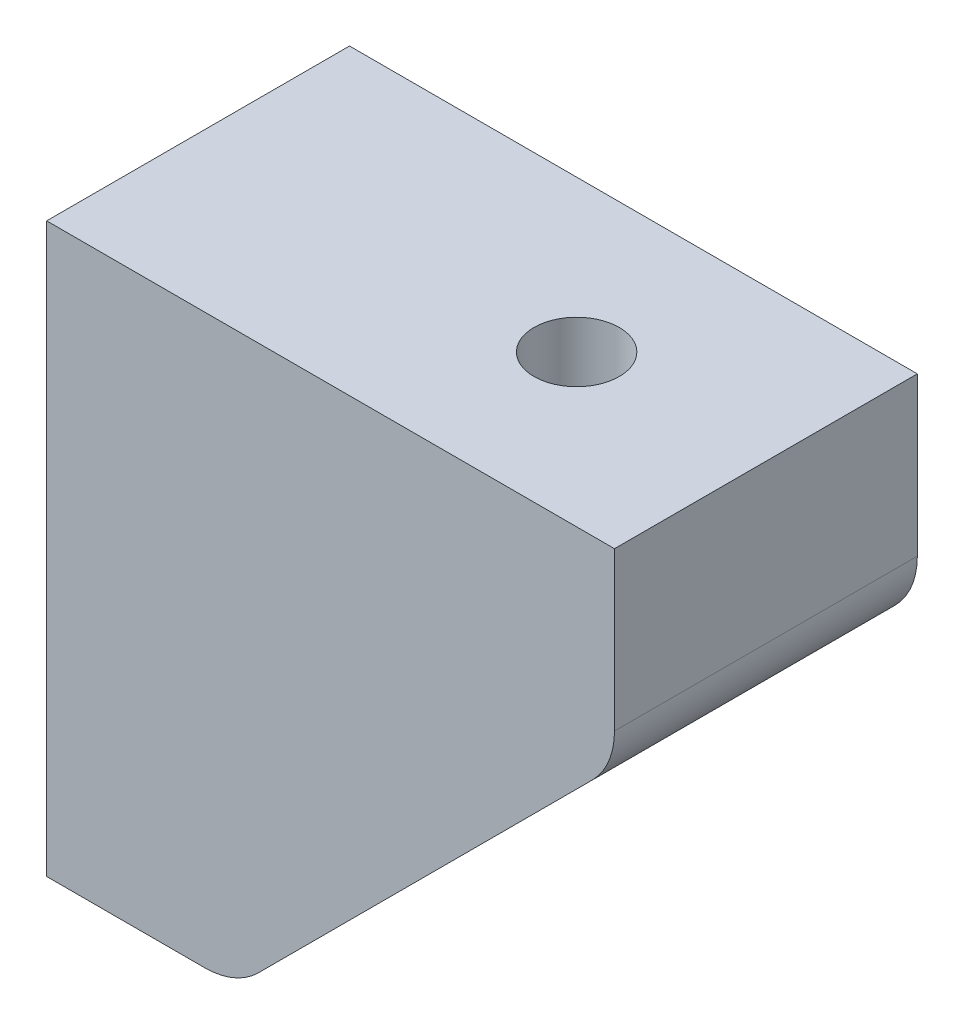
ISO-10303-21;
HEADER;
FILE_DESCRIPTION(('STEP AP214'),'2;1');
FILE_NAME('part.step','',(''),(''),'','','');
FILE_SCHEMA(('AUTOMOTIVE_DESIGN { 1 0 10303 214 1 1 1 1 }'));
ENDSEC;
DATA;
#1=APPLICATION_CONTEXT('core data for automotive mechanical design processes');
#2=APPLICATION_PROTOCOL_DEFINITION('international standard','automotive_design',2000,#1);
#3=PRODUCT_CONTEXT('',#1,'mechanical');
#4=PRODUCT('Part','Part','',(#3));
#5=PRODUCT_RELATED_PRODUCT_CATEGORY('part','',(#4));
#6=PRODUCT_DEFINITION_FORMATION('','',#4);
#7=PRODUCT_DEFINITION_CONTEXT('part definition',#1,'design');
#8=PRODUCT_DEFINITION('design','',#6,#7);
#9=PRODUCT_DEFINITION_SHAPE('','',#8);
#10=(LENGTH_UNIT() NAMED_UNIT(*) SI_UNIT(.MILLI.,.METRE.));
#11=(NAMED_UNIT(*) PLANE_ANGLE_UNIT() SI_UNIT($,.RADIAN.));
#12=(NAMED_UNIT(*) SI_UNIT($,.STERADIAN.) SOLID_ANGLE_UNIT());
#13=UNCERTAINTY_MEASURE_WITH_UNIT(LENGTH_MEASURE(1.E-05),#10,'distance_accuracy_value','');
#14=(GEOMETRIC_REPRESENTATION_CONTEXT(3) GLOBAL_UNCERTAINTY_ASSIGNED_CONTEXT((#13)) GLOBAL_UNIT_ASSIGNED_CONTEXT((#10,
#11,#12)) REPRESENTATION_CONTEXT('',''));
#15=CARTESIAN_POINT('',(0.,0.,0.));
#16=DIRECTION('',(0.,0.,1.));
#17=DIRECTION('',(1.,0.,0.));
#18=AXIS2_PLACEMENT_3D('',#15,#16,#17);
#19=CARTESIAN_POINT('',(0.,30.0000000000001,16.));
#20=DIRECTION('',(1.,0.,0.));
#21=DIRECTION('',(0.,1.,0.));
#22=AXIS2_PLACEMENT_3D('',#19,#20,#21);
#23=PLANE('',#22);
#24=CARTESIAN_POINT('',(0.,10.,8.));
#25=DIRECTION('',(-1.,0.,0.));
#26=DIRECTION('',(0.,-1.,0.));
#27=AXIS2_PLACEMENT_3D('',#24,#25,#26);
#28=CIRCLE('',#27,2.5);
#29=CARTESIAN_POINT('',(0.,7.50000000000004,8.));
#30=VERTEX_POINT('',#29);
#31=EDGE_CURVE('E231',#30,#30,#28,.T.);
#32=ORIENTED_EDGE('',*,*,#31,.F.);
#33=EDGE_LOOP('',(#32));
#34=FACE_BOUND('',#33,.T.);
#35=DIRECTION('',(0.,-1.,0.));
#36=VECTOR('',#35,1.);
#37=CARTESIAN_POINT('',(0.,30.0000000000001,0.));
#38=LINE('',#37,#36);
#39=CARTESIAN_POINT('',(0.,30.0000000000001,0.));
#40=VERTEX_POINT('',#39);
#41=CARTESIAN_POINT('',(0.,0.,0.));
#42=VERTEX_POINT('',#41);
#43=EDGE_CURVE('E127',#40,#42,#38,.T.);
#44=ORIENTED_EDGE('',*,*,#43,.T.);
#45=DIRECTION('',(0.,0.,-1.));
#46=VECTOR('',#45,1.);
#47=CARTESIAN_POINT('',(0.,0.,16.));
#48=LINE('',#47,#46);
#49=CARTESIAN_POINT('',(0.,0.,16.));
#50=VERTEX_POINT('',#49);
#51=EDGE_CURVE('E109',#50,#42,#48,.T.);
#52=ORIENTED_EDGE('',*,*,#51,.F.);
#53=DIRECTION('',(0.,-1.,0.));
#54=VECTOR('',#53,1.);
#55=CARTESIAN_POINT('',(0.,30.0000000000001,16.));
#56=LINE('',#55,#54);
#57=CARTESIAN_POINT('',(0.,30.0000000000001,16.));
#58=VERTEX_POINT('',#57);
#59=EDGE_CURVE('E114',#58,#50,#56,.T.);
#60=ORIENTED_EDGE('',*,*,#59,.F.);
#61=DIRECTION('',(0.,0.,-1.));
#62=VECTOR('',#61,1.);
#63=CARTESIAN_POINT('',(0.,30.0000000000001,16.));
#64=LINE('',#63,#62);
#65=EDGE_CURVE('E138',#58,#40,#64,.T.);
#66=ORIENTED_EDGE('',*,*,#65,.T.);
#67=EDGE_LOOP('',(#44,#52,#60,#66));
#68=FACE_BOUND('',#67,.T.);
#69=ADVANCED_FACE('F45',(#34,#68),#23,.F.);
#70=CARTESIAN_POINT('',(0.,0.,16.));
#71=DIRECTION('',(0.,1.,0.));
#72=DIRECTION('',(0.,0.,1.));
#73=AXIS2_PLACEMENT_3D('',#70,#71,#72);
#74=PLANE('',#73);
#75=DIRECTION('',(1.,0.,0.));
#76=VECTOR('',#75,1.);
#77=CARTESIAN_POINT('',(0.,0.,0.));
#78=LINE('',#77,#76);
#79=CARTESIAN_POINT('',(8.34314575050761,0.,0.));
#80=VERTEX_POINT('',#79);
#81=EDGE_CURVE('E253',#42,#80,#78,.T.);
#82=ORIENTED_EDGE('',*,*,#81,.T.);
#83=DIRECTION('',(0.,0.,-1.));
#84=VECTOR('',#83,1.);
#85=CARTESIAN_POINT('',(8.34314575050762,0.,16.));
#86=LINE('',#85,#84);
#87=CARTESIAN_POINT('',(8.34314575050761,0.,16.));
#88=VERTEX_POINT('',#87);
#89=EDGE_CURVE('E69',#80,#88,#86,.F.);
#90=ORIENTED_EDGE('',*,*,#89,.T.);
#91=DIRECTION('',(1.,0.,0.));
#92=VECTOR('',#91,1.);
#93=CARTESIAN_POINT('',(0.,0.,16.));
#94=LINE('',#93,#92);
#95=EDGE_CURVE('E105',#50,#88,#94,.T.);
#96=ORIENTED_EDGE('',*,*,#95,.F.);
#97=ORIENTED_EDGE('',*,*,#51,.T.);
#98=EDGE_LOOP('',(#82,#90,#96,#97));
#99=FACE_BOUND('',#98,.T.);
#100=ADVANCED_FACE('F107',(#99),#74,.F.);
#101=CARTESIAN_POINT('',(10.,0.,16.));
#102=DIRECTION('',(-0.707106781186549,0.707106781186546,0.));
#103=DIRECTION('',(-0.707106781186546,-0.707106781186549,0.));
#104=AXIS2_PLACEMENT_3D('',#101,#102,#103);
#105=PLANE('',#104);
#106=CARTESIAN_POINT('',(20.,10.,8.));
#107=DIRECTION('',(-0.707106781186549,0.707106781186546,0.));
#108=DIRECTION('',(-0.707106781186546,-0.707106781186549,0.));
#109=AXIS2_PLACEMENT_3D('',#106,#107,#108);
#110=ELLIPSE('',#109,7.07106781186547,5.);
#111=CARTESIAN_POINT('',(15.,5.00000000000004,8.));
#112=VERTEX_POINT('',#111);
#113=EDGE_CURVE('E228',#112,#112,#110,.T.);
#114=ORIENTED_EDGE('',*,*,#113,.T.);
#115=EDGE_LOOP('',(#114));
#116=FACE_BOUND('',#115,.T.);
#117=DIRECTION('',(0.707106781186546,0.707106781186549,0.));
#118=VECTOR('',#117,1.);
#119=CARTESIAN_POINT('',(10.,0.,16.));
#120=LINE('',#119,#118);
#121=CARTESIAN_POINT('',(11.1715728752538,1.17157287525382,16.));
#122=VERTEX_POINT('',#121);
#123=CARTESIAN_POINT('',(28.8284271247462,18.8284271247463,16.));
#124=VERTEX_POINT('',#123);
#125=EDGE_CURVE('E113',#122,#124,#120,.T.);
#126=ORIENTED_EDGE('',*,*,#125,.F.);
#127=DIRECTION('',(0.,0.,-1.));
#128=VECTOR('',#127,1.);
#129=CARTESIAN_POINT('',(11.1715728752538,1.17157287525382,16.));
#130=LINE('',#129,#128);
#131=CARTESIAN_POINT('',(11.1715728752538,1.17157287525382,0.));
#132=VERTEX_POINT('',#131);
#133=EDGE_CURVE('E197',#122,#132,#130,.T.);
#134=ORIENTED_EDGE('',*,*,#133,.T.);
#135=DIRECTION('',(0.707106781186546,0.707106781186549,0.));
#136=VECTOR('',#135,1.);
#137=CARTESIAN_POINT('',(10.,0.,0.));
#138=LINE('',#137,#136);
#139=CARTESIAN_POINT('',(28.8284271247462,18.8284271247463,0.));
#140=VERTEX_POINT('',#139);
#141=EDGE_CURVE('E256',#132,#140,#138,.T.);
#142=ORIENTED_EDGE('',*,*,#141,.T.);
#143=DIRECTION('',(0.,0.,-1.));
#144=VECTOR('',#143,1.);
#145=CARTESIAN_POINT('',(28.8284271247462,18.8284271247463,16.));
#146=LINE('',#145,#144);
#147=EDGE_CURVE('E213',#140,#124,#146,.F.);
#148=ORIENTED_EDGE('',*,*,#147,.T.);
#149=EDGE_LOOP('',(#126,#134,#142,#148));
#150=FACE_BOUND('',#149,.T.);
#151=ADVANCED_FACE('F178',(#116,#150),#105,.F.);
#152=CARTESIAN_POINT('',(30.,20.0000000000001,16.));
#153=DIRECTION('',(-1.,0.,0.));
#154=DIRECTION('',(0.,0.,1.));
#155=AXIS2_PLACEMENT_3D('',#152,#153,#154);
#156=PLANE('',#155);
#157=DIRECTION('',(0.,1.,0.));
#158=VECTOR('',#157,1.);
#159=CARTESIAN_POINT('',(30.,20.0000000000001,16.));
#160=LINE('',#159,#158);
#161=CARTESIAN_POINT('',(30.,21.6568542494925,16.));
#162=VERTEX_POINT('',#161);
#163=CARTESIAN_POINT('',(30.,30.0000000000001,16.));
#164=VERTEX_POINT('',#163);
#165=EDGE_CURVE('E246',#162,#164,#160,.T.);
#166=ORIENTED_EDGE('',*,*,#165,.F.);
#167=DIRECTION('',(0.,0.,-1.));
#168=VECTOR('',#167,1.);
#169=CARTESIAN_POINT('',(30.,21.6568542494925,16.));
#170=LINE('',#169,#168);
#171=CARTESIAN_POINT('',(30.,21.6568542494925,0.));
#172=VERTEX_POINT('',#171);
#173=EDGE_CURVE('E11',#162,#172,#170,.T.);
#174=ORIENTED_EDGE('',*,*,#173,.T.);
#175=DIRECTION('',(0.,1.,0.));
#176=VECTOR('',#175,1.);
#177=CARTESIAN_POINT('',(30.,20.0000000000001,0.));
#178=LINE('',#177,#176);
#179=CARTESIAN_POINT('',(30.,30.0000000000001,0.));
#180=VERTEX_POINT('',#179);
#181=EDGE_CURVE('E260',#172,#180,#178,.T.);
#182=ORIENTED_EDGE('',*,*,#181,.T.);
#183=DIRECTION('',(0.,0.,-1.));
#184=VECTOR('',#183,1.);
#185=CARTESIAN_POINT('',(30.,30.0000000000001,16.));
#186=LINE('',#185,#184);
#187=EDGE_CURVE('E130',#164,#180,#186,.T.);
#188=ORIENTED_EDGE('',*,*,#187,.F.);
#189=EDGE_LOOP('',(#166,#174,#182,#188));
#190=FACE_BOUND('',#189,.T.);
#191=ADVANCED_FACE('F275',(#190),#156,.F.);
#192=CARTESIAN_POINT('',(30.,30.0000000000001,16.));
#193=DIRECTION('',(0.,-1.,0.));
#194=DIRECTION('',(1.,0.,0.));
#195=AXIS2_PLACEMENT_3D('',#192,#193,#194);
#196=PLANE('',#195);
#197=CARTESIAN_POINT('',(20.,30.0000000000001,8.));
#198=DIRECTION('',(0.,1.,0.));
#199=DIRECTION('',(-1.,0.,0.));
#200=AXIS2_PLACEMENT_3D('',#197,#198,#199);
#201=CIRCLE('',#200,2.25);
#202=CARTESIAN_POINT('',(17.75,30.0000000000001,8.));
#203=VERTEX_POINT('',#202);
#204=EDGE_CURVE('E236',#203,#203,#201,.T.);
#205=ORIENTED_EDGE('',*,*,#204,.F.);
#206=EDGE_LOOP('',(#205));
#207=FACE_BOUND('',#206,.T.);
#208=DIRECTION('',(-1.,0.,0.));
#209=VECTOR('',#208,1.);
#210=CARTESIAN_POINT('',(30.,30.0000000000001,0.));
#211=LINE('',#210,#209);
#212=EDGE_CURVE('E124',#180,#40,#211,.T.);
#213=ORIENTED_EDGE('',*,*,#212,.T.);
#214=ORIENTED_EDGE('',*,*,#65,.F.);
#215=DIRECTION('',(-1.,0.,0.));
#216=VECTOR('',#215,1.);
#217=CARTESIAN_POINT('',(30.,30.0000000000001,16.));
#218=LINE('',#217,#216);
#219=EDGE_CURVE('E119',#164,#58,#218,.T.);
#220=ORIENTED_EDGE('',*,*,#219,.F.);
#221=ORIENTED_EDGE('',*,*,#187,.T.);
#222=EDGE_LOOP('',(#213,#214,#220,#221));
#223=FACE_BOUND('',#222,.T.);
#224=ADVANCED_FACE('F277',(#207,#223),#196,.F.);
#225=CARTESIAN_POINT('',(0.,0.,16.));
#226=DIRECTION('',(0.,0.,1.));
#227=DIRECTION('',(1.,0.,0.));
#228=AXIS2_PLACEMENT_3D('',#225,#226,#227);
#229=PLANE('',#228);
#230=ORIENTED_EDGE('',*,*,#95,.T.);
#231=CARTESIAN_POINT('',(8.34314575050762,4.,16.));
#232=DIRECTION('',(0.,0.,1.));
#233=DIRECTION('',(1.,0.,0.));
#234=AXIS2_PLACEMENT_3D('',#231,#232,#233);
#235=CIRCLE('',#234,4.);
#236=EDGE_CURVE('E54',#88,#122,#235,.T.);
#237=ORIENTED_EDGE('',*,*,#236,.T.);
#238=ORIENTED_EDGE('',*,*,#125,.T.);
#239=CARTESIAN_POINT('',(26.,21.6568542494925,16.));
#240=DIRECTION('',(0.,0.,1.));
#241=DIRECTION('',(1.,0.,0.));
#242=AXIS2_PLACEMENT_3D('',#239,#240,#241);
#243=CIRCLE('',#242,4.);
#244=EDGE_CURVE('E61',#124,#162,#243,.T.);
#245=ORIENTED_EDGE('',*,*,#244,.T.);
#246=ORIENTED_EDGE('',*,*,#165,.T.);
#247=ORIENTED_EDGE('',*,*,#219,.T.);
#248=ORIENTED_EDGE('',*,*,#59,.T.);
#249=EDGE_LOOP('',(#230,#237,#238,#245,#246,#247,#248));
#250=FACE_BOUND('',#249,.T.);
#251=ADVANCED_FACE('F117',(#250),#229,.T.);
#252=CARTESIAN_POINT('',(0.,0.,0.));
#253=DIRECTION('',(0.,0.,1.));
#254=DIRECTION('',(1.,0.,0.));
#255=AXIS2_PLACEMENT_3D('',#252,#253,#254);
#256=PLANE('',#255);
#257=ORIENTED_EDGE('',*,*,#141,.F.);
#258=CARTESIAN_POINT('',(8.34314575050762,4.,0.));
#259=DIRECTION('',(0.,0.,1.));
#260=DIRECTION('',(1.,0.,0.));
#261=AXIS2_PLACEMENT_3D('',#258,#259,#260);
#262=CIRCLE('',#261,4.);
#263=EDGE_CURVE('E205',#132,#80,#262,.F.);
#264=ORIENTED_EDGE('',*,*,#263,.T.);
#265=ORIENTED_EDGE('',*,*,#81,.F.);
#266=ORIENTED_EDGE('',*,*,#43,.F.);
#267=ORIENTED_EDGE('',*,*,#212,.F.);
#268=ORIENTED_EDGE('',*,*,#181,.F.);
#269=CARTESIAN_POINT('',(26.,21.6568542494925,0.));
#270=DIRECTION('',(0.,0.,1.));
#271=DIRECTION('',(1.,0.,0.));
#272=AXIS2_PLACEMENT_3D('',#269,#270,#271);
#273=CIRCLE('',#272,4.);
#274=EDGE_CURVE('E208',#172,#140,#273,.F.);
#275=ORIENTED_EDGE('',*,*,#274,.T.);
#276=EDGE_LOOP('',(#257,#264,#265,#266,#267,#268,#275));
#277=FACE_BOUND('',#276,.T.);
#278=ADVANCED_FACE('F269',(#277),#256,.F.);
#279=CARTESIAN_POINT('',(20.,0.,8.));
#280=DIRECTION('',(0.,1.,0.));
#281=DIRECTION('',(-1.,0.,0.));
#282=AXIS2_PLACEMENT_3D('',#279,#280,#281);
#283=CYLINDRICAL_SURFACE('',#282,2.25);
#284=CARTESIAN_POINT('',(20.,20.0000000000001,8.));
#285=DIRECTION('',(0.,1.,0.));
#286=DIRECTION('',(-1.,0.,0.));
#287=AXIS2_PLACEMENT_3D('',#284,#285,#286);
#288=CIRCLE('',#287,2.25);
#289=CARTESIAN_POINT('',(17.75,20.0000000000001,8.));
#290=VERTEX_POINT('',#289);
#291=EDGE_CURVE('E151',#290,#290,#288,.F.);
#292=CARTESIAN_POINT('',(17.75,20.0000000000001,8.));
#293=CARTESIAN_POINT('',(17.75,20.1041666666667,8.));
#294=CARTESIAN_POINT('',(17.75,20.2083333333334,8.));
#295=CARTESIAN_POINT('',(17.75,20.4166666666667,8.));
#296=CARTESIAN_POINT('',(17.75,20.5208333333334,8.));
#297=CARTESIAN_POINT('',(17.75,20.7291666666667,8.));
#298=CARTESIAN_POINT('',(17.75,20.8333333333334,8.));
#299=CARTESIAN_POINT('',(17.75,21.0416666666667,8.));
#300=CARTESIAN_POINT('',(17.75,21.1458333333334,8.));
#301=CARTESIAN_POINT('',(17.75,21.3541666666667,8.));
#302=CARTESIAN_POINT('',(17.75,21.4583333333334,8.));
#303=CARTESIAN_POINT('',(17.75,21.6666666666667,8.));
#304=CARTESIAN_POINT('',(17.75,21.7708333333334,8.));
#305=CARTESIAN_POINT('',(17.75,21.9791666666667,8.));
#306=CARTESIAN_POINT('',(17.75,22.0833333333334,8.));
#307=CARTESIAN_POINT('',(17.75,22.2916666666667,8.));
#308=CARTESIAN_POINT('',(17.75,22.3958333333334,8.));
#309=CARTESIAN_POINT('',(17.75,22.6041666666667,8.));
#310=CARTESIAN_POINT('',(17.75,22.7083333333334,8.));
#311=CARTESIAN_POINT('',(17.75,22.9166666666667,8.));
#312=CARTESIAN_POINT('',(17.75,23.0208333333334,8.));
#313=CARTESIAN_POINT('',(17.75,23.2291666666667,8.));
#314=CARTESIAN_POINT('',(17.75,23.3333333333334,8.));
#315=CARTESIAN_POINT('',(17.75,23.5416666666667,8.));
#316=CARTESIAN_POINT('',(17.75,23.6458333333334,8.));
#317=CARTESIAN_POINT('',(17.75,23.8541666666667,8.));
#318=CARTESIAN_POINT('',(17.75,23.9583333333334,8.));
#319=CARTESIAN_POINT('',(17.75,24.1666666666667,8.));
#320=CARTESIAN_POINT('',(17.75,24.2708333333334,8.));
#321=CARTESIAN_POINT('',(17.75,24.4791666666667,8.));
#322=CARTESIAN_POINT('',(17.75,24.5833333333334,8.));
#323=CARTESIAN_POINT('',(17.75,24.7916666666667,8.));
#324=CARTESIAN_POINT('',(17.75,24.8958333333334,8.));
#325=CARTESIAN_POINT('',(17.75,25.1041666666667,8.));
#326=CARTESIAN_POINT('',(17.75,25.2083333333334,8.));
#327=CARTESIAN_POINT('',(17.75,25.4166666666667,8.));
#328=CARTESIAN_POINT('',(17.75,25.5208333333334,8.));
#329=CARTESIAN_POINT('',(17.75,25.7291666666667,8.));
#330=CARTESIAN_POINT('',(17.75,25.8333333333334,8.));
#331=CARTESIAN_POINT('',(17.75,26.0416666666667,8.));
#332=CARTESIAN_POINT('',(17.75,26.1458333333334,8.));
#333=CARTESIAN_POINT('',(17.75,26.3541666666667,8.));
#334=CARTESIAN_POINT('',(17.75,26.4583333333334,8.));
#335=CARTESIAN_POINT('',(17.75,26.6666666666667,8.));
#336=CARTESIAN_POINT('',(17.75,26.7708333333334,8.));
#337=CARTESIAN_POINT('',(17.75,26.9791666666667,8.));
#338=CARTESIAN_POINT('',(17.75,27.0833333333334,8.));
#339=CARTESIAN_POINT('',(17.75,27.2916666666667,8.));
#340=CARTESIAN_POINT('',(17.75,27.3958333333334,8.));
#341=CARTESIAN_POINT('',(17.75,27.6041666666667,8.));
#342=CARTESIAN_POINT('',(17.75,27.7083333333334,8.));
#343=CARTESIAN_POINT('',(17.75,27.9166666666667,8.));
#344=CARTESIAN_POINT('',(17.75,28.0208333333334,8.));
#345=CARTESIAN_POINT('',(17.75,28.2291666666667,8.));
#346=CARTESIAN_POINT('',(17.75,28.3333333333334,8.));
#347=CARTESIAN_POINT('',(17.75,28.5416666666667,8.));
#348=CARTESIAN_POINT('',(17.75,28.6458333333334,8.));
#349=CARTESIAN_POINT('',(17.75,28.8541666666667,8.));
#350=CARTESIAN_POINT('',(17.75,28.9583333333334,8.));
#351=CARTESIAN_POINT('',(17.75,29.1666666666667,8.));
#352=CARTESIAN_POINT('',(17.75,29.2708333333334,8.));
#353=CARTESIAN_POINT('',(17.75,29.4791666666667,8.));
#354=CARTESIAN_POINT('',(17.75,29.5833333333334,8.));
#355=CARTESIAN_POINT('',(17.75,29.7916666666667,8.));
#356=CARTESIAN_POINT('',(17.75,29.8958333333334,8.));
#357=CARTESIAN_POINT('',(17.75,30.0000000000001,8.));
#358=B_SPLINE_CURVE_WITH_KNOTS('',3,(#292,#293,#294,#295,#296,#297,#298,#299,#300,#301,#302,
#303,#304,#305,#306,#307,#308,#309,#310,#311,#312,#313,#314,#315,#316,#317,#318,#319,#320,#321,
#322,#323,#324,#325,#326,#327,#328,#329,#330,#331,#332,#333,#334,#335,#336,#337,#338,#339,#340,
#341,#342,#343,#344,#345,#346,#347,#348,#349,#350,#351,#352,#353,#354,#355,#356,#357),
.UNSPECIFIED.,.F.,.F.,(4,2,2,2,2,2,2,2,2,2,2,2,2,2,2,2,2,2,2,2,2,2,2,2,2,2,2,2,2,2,2,2,4),(0.,
0.3125,0.625000000000001,0.937500000000001,1.25,1.5625,1.875,2.1875,2.5,2.8125,3.125,3.4375,
3.75,4.0625,4.375,4.6875,5.,5.3125,5.625,5.9375,6.25,6.5625,6.875,7.1875,7.5,7.8125,8.125,
8.43749999999999,8.74999999999999,9.06249999999999,9.37499999999999,9.68749999999999,
9.99999999999999),.UNSPECIFIED.);
#359=EDGE_CURVE('BSEAM315',#290,#203,#358,.T.);
#360=ORIENTED_EDGE('',*,*,#291,.T.);
#361=ORIENTED_EDGE('',*,*,#204,.T.);
#362=ORIENTED_EDGE('',*,*,#359,.T.);
#363=ORIENTED_EDGE('',*,*,#359,.F.);
#364=EDGE_LOOP('',(#360,#362,#361,#363));
#365=FACE_BOUND('',#364,.T.);
#366=ADVANCED_FACE('F315',(#365),#283,.F.);
#367=CARTESIAN_POINT('',(30.,10.,8.));
#368=DIRECTION('',(-1.,0.,0.));
#369=DIRECTION('',(0.,-1.,0.));
#370=AXIS2_PLACEMENT_3D('',#367,#368,#369);
#371=CYLINDRICAL_SURFACE('',#370,2.5);
#372=CARTESIAN_POINT('',(10.5,10.,8.));
#373=DIRECTION('',(1.,0.,0.));
#374=DIRECTION('',(0.,0.,-1.));
#375=AXIS2_PLACEMENT_3D('',#372,#373,#374);
#376=CIRCLE('',#375,2.5);
#377=CARTESIAN_POINT('',(10.5,7.50000000000004,8.));
#378=VERTEX_POINT('',#377);
#379=EDGE_CURVE('E135',#378,#378,#376,.T.);
#380=CARTESIAN_POINT('',(10.5,7.50000000000004,8.));
#381=CARTESIAN_POINT('',(10.390625,7.50000000000004,8.));
#382=CARTESIAN_POINT('',(10.28125,7.50000000000004,8.));
#383=CARTESIAN_POINT('',(10.0625,7.50000000000004,8.));
#384=CARTESIAN_POINT('',(9.95312500000002,7.50000000000004,8.));
#385=CARTESIAN_POINT('',(9.73437500000002,7.50000000000004,8.));
#386=CARTESIAN_POINT('',(9.62500000000002,7.50000000000004,8.));
#387=CARTESIAN_POINT('',(9.40625000000002,7.50000000000004,8.));
#388=CARTESIAN_POINT('',(9.29687500000002,7.50000000000004,8.));
#389=CARTESIAN_POINT('',(9.07812500000002,7.50000000000004,8.));
#390=CARTESIAN_POINT('',(8.96875000000002,7.50000000000004,8.));
#391=CARTESIAN_POINT('',(8.75000000000002,7.50000000000004,8.));
#392=CARTESIAN_POINT('',(8.64062500000002,7.50000000000004,8.));
#393=CARTESIAN_POINT('',(8.42187500000002,7.50000000000004,8.));
#394=CARTESIAN_POINT('',(8.31250000000002,7.50000000000004,8.));
#395=CARTESIAN_POINT('',(8.09375000000002,7.50000000000004,8.));
#396=CARTESIAN_POINT('',(7.98437500000002,7.50000000000004,8.));
#397=CARTESIAN_POINT('',(7.76562500000002,7.50000000000004,8.));
#398=CARTESIAN_POINT('',(7.65625000000002,7.50000000000004,8.));
#399=CARTESIAN_POINT('',(7.43750000000002,7.50000000000004,8.));
#400=CARTESIAN_POINT('',(7.32812500000002,7.50000000000004,8.));
#401=CARTESIAN_POINT('',(7.10937500000002,7.50000000000004,8.));
#402=CARTESIAN_POINT('',(7.00000000000002,7.50000000000004,8.));
#403=CARTESIAN_POINT('',(6.78125000000001,7.50000000000004,8.));
#404=CARTESIAN_POINT('',(6.67187500000001,7.50000000000004,8.));
#405=CARTESIAN_POINT('',(6.45312500000001,7.50000000000004,8.));
#406=CARTESIAN_POINT('',(6.34375000000001,7.50000000000004,8.));
#407=CARTESIAN_POINT('',(6.12500000000001,7.50000000000004,8.));
#408=CARTESIAN_POINT('',(6.01562500000001,7.50000000000004,8.));
#409=CARTESIAN_POINT('',(5.79687500000001,7.50000000000004,8.));
#410=CARTESIAN_POINT('',(5.68750000000001,7.50000000000004,8.));
#411=CARTESIAN_POINT('',(5.46875000000001,7.50000000000004,8.));
#412=CARTESIAN_POINT('',(5.35937500000001,7.50000000000004,8.));
#413=CARTESIAN_POINT('',(5.14062500000001,7.50000000000004,8.));
#414=CARTESIAN_POINT('',(5.03125000000001,7.50000000000004,8.));
#415=CARTESIAN_POINT('',(4.81250000000001,7.50000000000004,8.));
#416=CARTESIAN_POINT('',(4.70312500000001,7.50000000000004,8.));
#417=CARTESIAN_POINT('',(4.48437500000001,7.50000000000004,8.));
#418=CARTESIAN_POINT('',(4.37500000000001,7.50000000000004,8.));
#419=CARTESIAN_POINT('',(4.15625000000001,7.50000000000004,8.));
#420=CARTESIAN_POINT('',(4.04687500000001,7.50000000000004,8.));
#421=CARTESIAN_POINT('',(3.82812500000001,7.50000000000004,8.));
#422=CARTESIAN_POINT('',(3.71875000000001,7.50000000000004,8.));
#423=CARTESIAN_POINT('',(3.50000000000001,7.50000000000004,8.));
#424=CARTESIAN_POINT('',(3.39062500000001,7.50000000000004,8.));
#425=CARTESIAN_POINT('',(3.17187500000001,7.50000000000004,8.));
#426=CARTESIAN_POINT('',(3.06250000000001,7.50000000000004,8.));
#427=CARTESIAN_POINT('',(2.84375000000001,7.50000000000004,8.));
#428=CARTESIAN_POINT('',(2.73437500000001,7.50000000000004,8.));
#429=CARTESIAN_POINT('',(2.51562500000001,7.50000000000004,8.));
#430=CARTESIAN_POINT('',(2.40625,7.50000000000004,8.));
#431=CARTESIAN_POINT('',(2.1875,7.50000000000004,8.));
#432=CARTESIAN_POINT('',(2.078125,7.50000000000004,8.));
#433=CARTESIAN_POINT('',(1.859375,7.50000000000004,8.));
#434=CARTESIAN_POINT('',(1.75,7.50000000000004,8.));
#435=CARTESIAN_POINT('',(1.53125,7.50000000000004,8.));
#436=CARTESIAN_POINT('',(1.421875,7.50000000000004,8.));
#437=CARTESIAN_POINT('',(1.203125,7.50000000000004,8.));
#438=CARTESIAN_POINT('',(1.09375,7.50000000000004,8.));
#439=CARTESIAN_POINT('',(0.875000000000002,7.50000000000004,8.));
#440=CARTESIAN_POINT('',(0.765625000000001,7.50000000000004,8.));
#441=CARTESIAN_POINT('',(0.546875,7.50000000000004,8.));
#442=CARTESIAN_POINT('',(0.437499999999999,7.50000000000004,8.));
#443=CARTESIAN_POINT('',(0.218749999999999,7.50000000000004,8.));
#444=CARTESIAN_POINT('',(0.109375,7.50000000000004,8.));
#445=CARTESIAN_POINT('',(0.,7.50000000000004,8.));
#446=B_SPLINE_CURVE_WITH_KNOTS('',3,(#380,#381,#382,#383,#384,#385,#386,#387,#388,#389,#390,
#391,#392,#393,#394,#395,#396,#397,#398,#399,#400,#401,#402,#403,#404,#405,#406,#407,#408,#409,
#410,#411,#412,#413,#414,#415,#416,#417,#418,#419,#420,#421,#422,#423,#424,#425,#426,#427,#428,
#429,#430,#431,#432,#433,#434,#435,#436,#437,#438,#439,#440,#441,#442,#443,#444,#445),
.UNSPECIFIED.,.F.,.F.,(4,2,2,2,2,2,2,2,2,2,2,2,2,2,2,2,2,2,2,2,2,2,2,2,2,2,2,2,2,2,2,2,4),(0.,
0.328125000000002,0.656250000000001,0.984375000000003,1.3125,1.640625,1.96875000000001,2.296875,
2.62500000000001,2.95312500000001,3.28125000000001,3.60937500000001,3.93750000000001,
4.26562500000001,4.59375000000001,4.92187500000001,5.25000000000001,5.57812500000001,
5.90625000000001,6.23437500000001,6.56250000000001,6.89062500000002,7.21875000000002,
7.54687500000002,7.87500000000002,8.20312500000002,8.53125000000002,8.85937500000002,
9.18750000000002,9.51562500000002,9.84375000000002,10.171875,10.5),.UNSPECIFIED.);
#447=EDGE_CURVE('BSEAM168',#378,#30,#446,.T.);
#448=ORIENTED_EDGE('',*,*,#379,.T.);
#449=ORIENTED_EDGE('',*,*,#31,.T.);
#450=ORIENTED_EDGE('',*,*,#447,.T.);
#451=ORIENTED_EDGE('',*,*,#447,.F.);
#452=EDGE_LOOP('',(#448,#450,#449,#451));
#453=FACE_BOUND('',#452,.T.);
#454=ADVANCED_FACE('F168',(#453),#371,.F.);
#455=CARTESIAN_POINT('',(30.,10.,8.));
#456=DIRECTION('',(-1.,0.,0.));
#457=DIRECTION('',(0.,-1.,0.));
#458=AXIS2_PLACEMENT_3D('',#455,#456,#457);
#459=CYLINDRICAL_SURFACE('',#458,5.);
#460=CARTESIAN_POINT('',(13.0000000000001,10.,8.));
#461=DIRECTION('',(-1.,0.,0.));
#462=DIRECTION('',(0.,0.,1.));
#463=AXIS2_PLACEMENT_3D('',#460,#461,#462);
#464=CIRCLE('',#463,5.);
#465=CARTESIAN_POINT('',(13.0000000000001,10.,13.));
#466=VERTEX_POINT('',#465);
#467=EDGE_CURVE('E129',#466,#466,#464,.T.);
#468=ORIENTED_EDGE('',*,*,#467,.T.);
#469=EDGE_LOOP('',(#468));
#470=FACE_BOUND('',#469,.T.);
#471=CARTESIAN_POINT('',(16.,15.,8.));
#472=CARTESIAN_POINT('',(16.0000007676539,14.9999992500715,8.09604638922696));
#473=CARTESIAN_POINT('',(16.0034657012846,14.9972260917869,8.19210753610177));
#474=CARTESIAN_POINT('',(16.0172658187929,14.986196441359,8.38345699795925));
#475=CARTESIAN_POINT('',(16.0276046384607,14.9779370473947,8.47874487692667));
#476=CARTESIAN_POINT('',(16.0549958830148,14.95610616328,8.6678960971538));
#477=CARTESIAN_POINT('',(16.0720592488998,14.9425260163465,8.76175685667556));
#478=CARTESIAN_POINT('',(16.1126101869622,14.9103614705403,8.94722184071497));
#479=CARTESIAN_POINT('',(16.1361006731936,14.8917748017718,9.0388250210609));
#480=CARTESIAN_POINT('',(16.2153329942576,14.8293510648329,9.30807557979515));
#481=CARTESIAN_POINT('',(16.2800510338738,14.778675860507,9.48159866642755));
#482=CARTESIAN_POINT('',(16.4302503559933,14.6627067622658,9.81389737735533));
#483=CARTESIAN_POINT('',(16.5157317042729,14.5974128220395,9.97267295492965));
#484=CARTESIAN_POINT('',(16.6736868645101,14.4791282113277,10.2248639292531));
#485=CARTESIAN_POINT('',(16.7413473643456,14.4290440035265,10.3227402197662));
#486=CARTESIAN_POINT('',(16.8840057339144,14.3251620211011,10.5108792189643));
#487=CARTESIAN_POINT('',(16.9590035517296,14.2713642727544,10.6011419815135));
#488=CARTESIAN_POINT('',(17.1159636745199,14.1610738876288,10.7741707332071));
#489=CARTESIAN_POINT('',(17.1979459007938,14.1045737586314,10.8569137859849));
#490=CARTESIAN_POINT('',(17.3682397983688,13.9902602643319,11.014513821141));
#491=CARTESIAN_POINT('',(17.4565490154843,13.9324474141036,11.0893738337515));
#492=CARTESIAN_POINT('',(17.6407406318536,13.8158793340247,11.2322900773087));
#493=CARTESIAN_POINT('',(17.7367205726385,13.7571236341872,11.300220253137));
#494=CARTESIAN_POINT('',(17.9349832474423,13.6411293908815,11.4277699507192));
#495=CARTESIAN_POINT('',(18.0372679593475,13.5838913316529,11.4873868451603));
#496=CARTESIAN_POINT('',(18.247927510792,13.4730040656124,11.5978250374114));
#497=CARTESIAN_POINT('',(18.3562847649318,13.4193453908221,11.6486701537286));
#498=CARTESIAN_POINT('',(18.5793826997049,13.3178746509829,11.7411787029395));
#499=CARTESIAN_POINT('',(18.6941178206929,13.270057606507,11.7828499802972));
#500=CARTESIAN_POINT('',(18.947710426075,13.1767021066541,11.8617142287773));
#501=CARTESIAN_POINT('',(19.0876106993092,13.1325716319431,11.8973077513999));
#502=CARTESIAN_POINT('',(19.3744381132965,13.0614006993478,11.9534696966151));
#503=CARTESIAN_POINT('',(19.5213470214841,13.0343182487694,11.9740750576953));
#504=CARTESIAN_POINT('',(19.8203813312705,13.001683909376,11.9987963791288));
#505=CARTESIAN_POINT('',(19.9725410473948,12.9963218049933,12.0027670014749));
#506=CARTESIAN_POINT('',(20.2754117079388,13.0087993797071,11.9933895447118));
#507=CARTESIAN_POINT('',(20.4261213175347,13.0266586948817,11.9800268085032));
#508=CARTESIAN_POINT('',(20.7444399948995,13.086414701651,11.9339069583972));
#509=CARTESIAN_POINT('',(20.9109987003219,13.1316382087437,11.8984399445406));
#510=CARTESIAN_POINT('',(21.2330884824285,13.2399478268983,11.8088871552876));
#511=CARTESIAN_POINT('',(21.388585232108,13.3030867457868,11.7547462330513));
#512=CARTESIAN_POINT('',(21.6497837139866,13.4222763274263,11.6459308316069));
#513=CARTESIAN_POINT('',(21.7581007886366,13.4760534543828,11.5948853728613));
#514=CARTESIAN_POINT('',(21.9684490944712,13.5870318510308,11.4841559447593));
#515=CARTESIAN_POINT('',(22.0704773892381,13.6442346960796,11.4244679828778));
#516=CARTESIAN_POINT('',(22.2683872018107,13.7602062652028,11.2967115323911));
#517=CARTESIAN_POINT('',(22.3642613966168,13.8189767411678,11.2286333311125));
#518=CARTESIAN_POINT('',(22.5496673500319,13.9364533389305,11.0843140212928));
#519=CARTESIAN_POINT('',(22.639200147583,13.9951594697112,11.008074255065));
#520=CARTESIAN_POINT('',(22.8140101235964,14.1127070493193,10.8453441955446));
#521=CARTESIAN_POINT('',(22.8991090406098,14.1715099912301,10.7586340113867));
#522=CARTESIAN_POINT('',(23.0619130937561,14.2862547777984,10.5767399318482));
#523=CARTESIAN_POINT('',(23.1396171393685,14.3421961999072,10.4815547906609));
#524=CARTESIAN_POINT('',(23.2867573053731,14.4497483229544,10.283076531935));
#525=CARTESIAN_POINT('',(23.3562119507816,14.5013686473438,10.1798024796945));
#526=CARTESIAN_POINT('',(23.4861249415168,14.5990475048721,9.96536649556131));
#527=CARTESIAN_POINT('',(23.5465873468848,14.6451085462735,9.85420815715068));
#528=CARTESIAN_POINT('',(23.6810867237149,14.7484549444979,9.5756005587103));
#529=CARTESIAN_POINT('',(23.7500220999001,14.8022279548035,9.40425498615802));
#530=CARTESIAN_POINT('',(23.8357293521389,14.8695500876464,9.13837354893344));
#531=CARTESIAN_POINT('',(23.8613525356034,14.8897706493769,9.04825004232709));
#532=CARTESIAN_POINT('',(23.9063630582772,14.9253913742574,8.8655405598169));
#533=CARTESIAN_POINT('',(23.9257533117745,14.9407937901038,8.77295575671317));
#534=CARTESIAN_POINT('',(23.9580805109284,14.9665184461564,8.58541259779352));
#535=CARTESIAN_POINT('',(23.9709797988717,14.9768110369003,8.4904436727755));
#536=CARTESIAN_POINT('',(23.9899309236985,14.9919451308873,8.2994300318131));
#537=CARTESIAN_POINT('',(23.9959855705412,14.9967888710659,8.20338577369579));
#538=CARTESIAN_POINT('',(24.0011418998756,15.0009132538354,8.01097891945941));
#539=CARTESIAN_POINT('',(24.0002431440118,15.0001935456962,7.91461630365327));
#540=CARTESIAN_POINT('',(23.9915194220691,14.9932177293551,7.72243592372434));
#541=CARTESIAN_POINT('',(23.9836948101995,14.9869619042872,7.62661813198981));
#542=CARTESIAN_POINT('',(23.9518293985393,14.9615301840797,7.3566237978917));
#543=CARTESIAN_POINT('',(23.9197003154007,14.9359251714072,7.18390967369849));
#544=CARTESIAN_POINT('',(23.8342569725143,14.8683521415209,6.84729718499104));
#545=CARTESIAN_POINT('',(23.7809364255526,14.826379268259,6.68340145317094));
#546=CARTESIAN_POINT('',(23.6516988659432,14.725796439451,6.35753745015487));
#547=CARTESIAN_POINT('',(23.5745883227446,14.6663181067349,6.19631524178957));
#548=CARTESIAN_POINT('',(23.4022758020823,14.5356726024527,5.88917751028197));
#549=CARTESIAN_POINT('',(23.3070729224052,14.4645048479924,5.74326275104213));
#550=CARTESIAN_POINT('',(23.0815513267087,14.2998736995357,5.44149610137));
#551=CARTESIAN_POINT('',(22.9479966072965,14.2047393817286,5.28898584594332));
#552=CARTESIAN_POINT('',(22.6612260866735,14.0088699735553,5.00692602370211));
#553=CARTESIAN_POINT('',(22.5079543318471,13.9081194250762,4.8774444008404));
#554=CARTESIAN_POINT('',(22.2471311101696,13.7474827031511,4.68863026846476));
#555=CARTESIAN_POINT('',(22.1452788111765,13.6870948688025,4.62172516851049));
#556=CARTESIAN_POINT('',(21.9347554845189,13.5687083153576,4.49689995725019));
#557=CARTESIAN_POINT('',(21.8260808822575,13.5107108755372,4.4389846123174));
#558=CARTESIAN_POINT('',(21.602221488468,13.3996622702733,4.33282453102319));
#559=CARTESIAN_POINT('',(21.487060991757,13.3465943923303,4.28454643042893));
#560=CARTESIAN_POINT('',(21.2499190098446,13.2481807749737,4.19821069031371));
#561=CARTESIAN_POINT('',(21.1279461651776,13.2028255358976,4.16014044392479));
#562=CARTESIAN_POINT('',(20.8678265775587,13.1203884086639,4.09279668857813));
#563=CARTESIAN_POINT('',(20.729154680385,13.0841943348073,4.0644088058601));
#564=CARTESIAN_POINT('',(20.4463247642843,13.0298674313654,4.0224218872535));
#565=CARTESIAN_POINT('',(20.3021815440949,13.0116890483021,4.0087855433976));
#566=CARTESIAN_POINT('',(20.0113026041562,12.9964947334314,3.99735882075014));
#567=CARTESIAN_POINT('',(19.8645571418409,12.9995925091774,3.99965358431282));
#568=CARTESIAN_POINT('',(19.574031563725,13.0266154431258,4.02006962923918));
#569=CARTESIAN_POINT('',(19.4302565194056,13.0505736216307,4.03821600254652));
#570=CARTESIAN_POINT('',(19.1107866882603,13.1241414909247,4.09584498857894));
#571=CARTESIAN_POINT('',(18.9371548312483,13.1789849823007,4.1398149861678));
#572=CARTESIAN_POINT('',(18.6027320434361,13.3057783394867,4.24783686251359));
#573=CARTESIAN_POINT('',(18.4419807156193,13.3777784474275,4.31194790207137));
#574=CARTESIAN_POINT('',(18.1756497161866,13.5098214621651,4.43810281142706));
#575=CARTESIAN_POINT('',(18.0669752624099,13.5677739749437,4.49594660062428));
#576=CARTESIAN_POINT('',(17.8563190174512,13.6861580294968,4.62070606822092));
#577=CARTESIAN_POINT('',(17.7543399736194,13.7465905725854,4.68762543653035));
#578=CARTESIAN_POINT('',(17.5570272137112,13.8680845792066,4.8303438357191));
#579=CARTESIAN_POINT('',(17.4616999143587,13.9291465865471,4.9061512567619));
#580=CARTESIAN_POINT('',(17.2779962989172,14.0502516318959,5.06647750258524));
#581=CARTESIAN_POINT('',(17.1896188879802,14.1102948292286,5.15099495036868));
#582=CARTESIAN_POINT('',(17.019091751671,14.2287118200936,5.32985927497678));
#583=CARTESIAN_POINT('',(16.9370398517825,14.2870530314762,5.42432137012112));
#584=CARTESIAN_POINT('',(16.7811370075282,14.39979346036,5.62202361266578));
#585=CARTESIAN_POINT('',(16.7072874244308,14.4541920230145,5.72526521212047));
#586=CARTESIAN_POINT('',(16.5688634275759,14.5574752677065,5.94000840574181));
#587=CARTESIAN_POINT('',(16.5042670166469,14.6063729651901,6.05148942205426));
#588=CARTESIAN_POINT('',(16.3852598955594,14.6973267036069,6.28229012042694));
#589=CARTESIAN_POINT('',(16.3308429514202,14.7393869297771,6.4016049441148));
#590=CARTESIAN_POINT('',(16.2164381844239,14.8284183185065,6.68995742573256));
#591=CARTESIAN_POINT('',(16.1610196372283,14.8720667894095,6.86193347017046));
#592=CARTESIAN_POINT('',(16.095475973429,14.9239354557056,7.12651517630198));
#593=CARTESIAN_POINT('',(16.0765663971458,14.9389514864556,7.21574252361163));
#594=CARTESIAN_POINT('',(16.0448202192518,14.9642070425714,7.395930724566));
#595=CARTESIAN_POINT('',(16.0319809142995,14.9744486941362,7.48689078775034));
#596=CARTESIAN_POINT('',(16.0148786444011,14.9881031996032,7.64822353989965));
#597=CARTESIAN_POINT('',(16.0093051659039,14.9925584953468,7.71837448757125));
#598=CARTESIAN_POINT('',(16.0018651495667,14.9985075002531,7.8590142588725));
#599=CARTESIAN_POINT('',(15.9999994365517,15.0000005504382,7.92950315418636));
#600=CARTESIAN_POINT('',(16.,15.,8.));
#601=B_SPLINE_CURVE_WITH_KNOTS('',3,(#471,#472,#473,#474,#475,#476,#477,#478,#479,#480,#481,
#482,#483,#484,#485,#486,#487,#488,#489,#490,#491,#492,#493,#494,#495,#496,#497,#498,#499,#500,
#501,#502,#503,#504,#505,#506,#507,#508,#509,#510,#511,#512,#513,#514,#515,#516,#517,#518,#519,
#520,#521,#522,#523,#524,#525,#526,#527,#528,#529,#530,#531,#532,#533,#534,#535,#536,#537,#538,
#539,#540,#541,#542,#543,#544,#545,#546,#547,#548,#549,#550,#551,#552,#553,#554,#555,#556,#557,
#558,#559,#560,#561,#562,#563,#564,#565,#566,#567,#568,#569,#570,#571,#572,#573,#574,#575,#576,
#577,#578,#579,#580,#581,#582,#583,#584,#585,#586,#587,#588,#589,#590,#591,#592,#593,#594,#595,
#596,#597,#598,#599,#600),.UNSPECIFIED.,.T.,.F.,(4,2,2,2,2,2,2,2,2,2,2,2,2,2,2,2,2,2,2,2,2,2,2,
2,2,2,2,2,2,2,2,2,2,2,2,2,2,2,2,2,2,2,2,2,2,2,2,2,2,2,2,2,2,2,2,2,2,2,2,2,2,2,2,2,4),(0.,
0.288062758667623,0.576278003111146,0.864964129651048,1.15378136390405,1.72709009312658,
2.30040063856698,2.68722645474264,3.07404953396829,3.46201544535746,3.84983167444716,
4.24376978737867,4.63783211891323,5.03080698743563,5.42344451024555,5.8747483785656,
6.32493619990523,6.77904922175819,7.23354649231948,7.75923125238324,8.28648192165713,
8.6798007428228,9.07330184628004,9.46726282862533,9.86115911639957,10.2656076837238,
10.6701158028798,11.0736976518487,11.4770967247701,12.0514034064526,12.3386733158201,
12.6258087123431,12.9145912709401,13.2032552313199,13.4919373897649,13.7806047849779,
14.3106110383656,14.8407746547939,15.4037260006338,15.9667054266294,16.6361816844955,
17.3076015388324,17.7152021542886,18.1230181470313,18.5293968097803,18.9352712520426,
19.3719136407629,19.8074491211246,20.2453140663445,20.6838733784182,21.242737078473,
21.8032579383456,22.2109901693715,22.6188886741923,23.0271753760054,23.4353976291479,
23.8490189589148,24.2627088316334,24.675398328476,25.0878342578457,25.6427442660391,
25.9197834242688,26.1966990890726,26.4080865235327,26.6195209777156),.UNSPECIFIED.);
#602=CARTESIAN_POINT('',(16.,15.,8.));
#603=VERTEX_POINT('',#602);
#604=EDGE_CURVE('E142',#603,#603,#601,.T.);
#605=ORIENTED_EDGE('',*,*,#604,.T.);
#606=EDGE_LOOP('',(#605));
#607=FACE_BOUND('',#606,.T.);
#608=ORIENTED_EDGE('',*,*,#113,.F.);
#609=EDGE_LOOP('',(#608));
#610=FACE_BOUND('',#609,.T.);
#611=ADVANCED_FACE('F153',(#470,#607,#610),#459,.F.);
#612=CARTESIAN_POINT('',(20.,20.0000000000001,8.));
#613=DIRECTION('',(0.,1.,0.));
#614=DIRECTION('',(-1.,0.,0.));
#615=AXIS2_PLACEMENT_3D('',#612,#613,#614);
#616=PLANE('',#615);
#617=CARTESIAN_POINT('',(20.,20.0000000000001,8.));
#618=DIRECTION('',(0.,1.,0.));
#619=DIRECTION('',(-1.,0.,0.));
#620=AXIS2_PLACEMENT_3D('',#617,#618,#619);
#621=CIRCLE('',#620,4.);
#622=CARTESIAN_POINT('',(16.,20.0000000000001,8.));
#623=VERTEX_POINT('',#622);
#624=EDGE_CURVE('E152',#623,#623,#621,.T.);
#625=ORIENTED_EDGE('',*,*,#624,.F.);
#626=EDGE_LOOP('',(#625));
#627=FACE_BOUND('',#626,.T.);
#628=ORIENTED_EDGE('',*,*,#291,.F.);
#629=EDGE_LOOP('',(#628));
#630=FACE_BOUND('',#629,.T.);
#631=ADVANCED_FACE('F161',(#627,#630),#616,.F.);
#632=CARTESIAN_POINT('',(20.,0.,8.));
#633=DIRECTION('',(0.,1.,0.));
#634=DIRECTION('',(-1.,0.,0.));
#635=AXIS2_PLACEMENT_3D('',#632,#633,#634);
#636=CYLINDRICAL_SURFACE('',#635,4.);
#637=ORIENTED_EDGE('',*,*,#624,.T.);
#638=EDGE_LOOP('',(#637));
#639=FACE_BOUND('',#638,.T.);
#640=ORIENTED_EDGE('',*,*,#604,.F.);
#641=EDGE_LOOP('',(#640));
#642=FACE_BOUND('',#641,.T.);
#643=ADVANCED_FACE('F156',(#639,#642),#636,.F.);
#644=CARTESIAN_POINT('',(13.0000000000001,10.,8.));
#645=DIRECTION('',(1.,0.,0.));
#646=DIRECTION('',(0.,0.,-1.));
#647=AXIS2_PLACEMENT_3D('',#644,#645,#646);
#648=CONICAL_SURFACE('',#647,5.,0.785398163397443);
#649=ORIENTED_EDGE('',*,*,#379,.F.);
#650=EDGE_LOOP('',(#649));
#651=FACE_BOUND('',#650,.T.);
#652=ORIENTED_EDGE('',*,*,#467,.F.);
#653=EDGE_LOOP('',(#652));
#654=FACE_BOUND('',#653,.T.);
#655=ADVANCED_FACE('F160',(#651,#654),#648,.F.);
#656=CARTESIAN_POINT('',(8.34314575050762,4.,16.));
#657=DIRECTION('',(0.,0.,-1.));
#658=DIRECTION('',(-1.,0.,0.));
#659=AXIS2_PLACEMENT_3D('',#656,#657,#658);
#660=CYLINDRICAL_SURFACE('',#659,4.);
#661=ORIENTED_EDGE('',*,*,#236,.F.);
#662=ORIENTED_EDGE('',*,*,#89,.F.);
#663=ORIENTED_EDGE('',*,*,#263,.F.);
#664=ORIENTED_EDGE('',*,*,#133,.F.);
#665=EDGE_LOOP('',(#661,#662,#663,#664));
#666=FACE_BOUND('',#665,.T.);
#667=ADVANCED_FACE('F187',(#666),#660,.T.);
#668=CARTESIAN_POINT('',(26.,21.6568542494925,16.));
#669=DIRECTION('',(0.,0.,-1.));
#670=DIRECTION('',(-1.,0.,0.));
#671=AXIS2_PLACEMENT_3D('',#668,#669,#670);
#672=CYLINDRICAL_SURFACE('',#671,4.);
#673=ORIENTED_EDGE('',*,*,#244,.F.);
#674=ORIENTED_EDGE('',*,*,#147,.F.);
#675=ORIENTED_EDGE('',*,*,#274,.F.);
#676=ORIENTED_EDGE('',*,*,#173,.F.);
#677=EDGE_LOOP('',(#673,#674,#675,#676));
#678=FACE_BOUND('',#677,.T.);
#679=ADVANCED_FACE('F47',(#678),#672,.T.);
#680=CLOSED_SHELL('',(#69,#100,#151,#191,#224,#251,#278,#366,#454,#611,#631,#643,#655,#667,#679));
#681=MANIFOLD_SOLID_BREP('B2',#680);
#682=ADVANCED_BREP_SHAPE_REPRESENTATION('',(#18,#681),#14);
#683=SHAPE_DEFINITION_REPRESENTATION(#9,#682);
ENDSEC;
END-ISO-10303-21;
